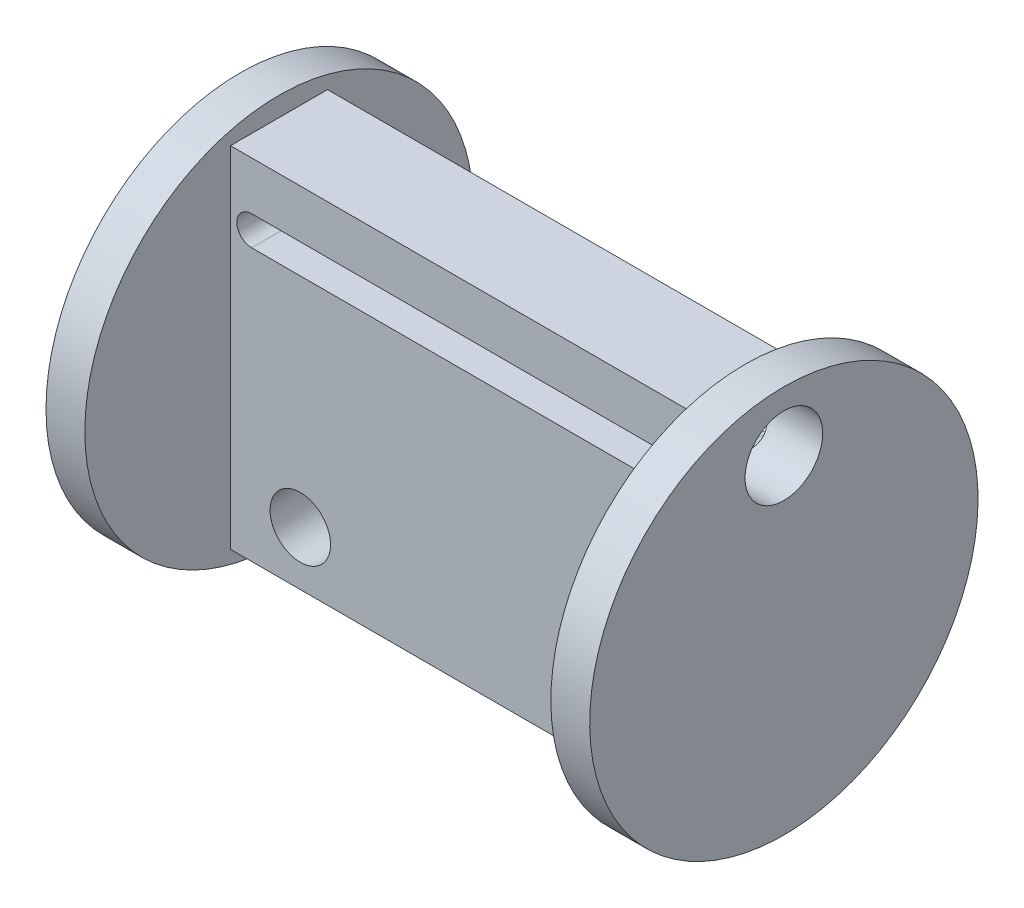
ISO-10303-21;
HEADER;
FILE_DESCRIPTION(('STEP AP214'),'2;1');
FILE_NAME('part.step','',(''),(''),'','','');
FILE_SCHEMA(('AUTOMOTIVE_DESIGN { 1 0 10303 214 1 1 1 1 }'));
ENDSEC;
DATA;
#1=APPLICATION_CONTEXT('core data for automotive mechanical design processes');
#2=APPLICATION_PROTOCOL_DEFINITION('international standard','automotive_design',2000,#1);
#3=PRODUCT_CONTEXT('',#1,'mechanical');
#4=PRODUCT('Part','Part','',(#3));
#5=PRODUCT_RELATED_PRODUCT_CATEGORY('part','',(#4));
#6=PRODUCT_DEFINITION_FORMATION('','',#4);
#7=PRODUCT_DEFINITION_CONTEXT('part definition',#1,'design');
#8=PRODUCT_DEFINITION('design','',#6,#7);
#9=PRODUCT_DEFINITION_SHAPE('','',#8);
#10=(LENGTH_UNIT() NAMED_UNIT(*) SI_UNIT(.MILLI.,.METRE.));
#11=(NAMED_UNIT(*) PLANE_ANGLE_UNIT() SI_UNIT($,.RADIAN.));
#12=(NAMED_UNIT(*) SI_UNIT($,.STERADIAN.) SOLID_ANGLE_UNIT());
#13=UNCERTAINTY_MEASURE_WITH_UNIT(LENGTH_MEASURE(1.E-05),#10,'distance_accuracy_value','');
#14=(GEOMETRIC_REPRESENTATION_CONTEXT(3) GLOBAL_UNCERTAINTY_ASSIGNED_CONTEXT((#13)) GLOBAL_UNIT_ASSIGNED_CONTEXT((#10,
#11,#12)) REPRESENTATION_CONTEXT('',''));
#15=CARTESIAN_POINT('',(0.,0.,0.));
#16=DIRECTION('',(0.,0.,1.));
#17=DIRECTION('',(1.,0.,0.));
#18=AXIS2_PLACEMENT_3D('',#15,#16,#17);
#19=CARTESIAN_POINT('',(1.0894743939662,-3.25,0.));
#20=DIRECTION('',(0.,0.,1.));
#21=DIRECTION('',(1.,0.,0.));
#22=AXIS2_PLACEMENT_3D('',#19,#20,#21);
#23=CYLINDRICAL_SURFACE('',#22,0.760008644446817);
#24=DIRECTION('',(0.,0.,1.));
#25=VECTOR('',#24,1.);
#26=CARTESIAN_POINT('',(1.0894743939662,-4.01000864444682,0.));
#27=LINE('',#26,#25);
#28=CARTESIAN_POINT('',(1.0894743939662,-4.01000864444682,3.01012686693727));
#29=VERTEX_POINT('',#28);
#30=CARTESIAN_POINT('',(1.0894743939662,-4.01000864444682,5.));
#31=VERTEX_POINT('',#30);
#32=EDGE_CURVE('E159',#29,#31,#27,.T.);
#33=ORIENTED_EDGE('',*,*,#32,.F.);
#34=CARTESIAN_POINT('',(1.0894743939662,-4.01000864444682,3.01012686693726));
#35=CARTESIAN_POINT('',(1.07707669593675,-4.01001725766991,3.01008270512241));
#36=CARTESIAN_POINT('',(1.06474771044255,-4.00970579351794,3.01127594601003));
#37=CARTESIAN_POINT('',(1.0407013282592,-4.00853348965439,3.01569435581647));
#38=CARTESIAN_POINT('',(1.02897697959905,-4.00768243768711,3.01888331081213));
#39=CARTESIAN_POINT('',(1.00119801770201,-4.0050453540771,3.02861536365552));
#40=CARTESIAN_POINT('',(0.985477073105324,-4.00301368661534,3.03601396432438));
#41=CARTESIAN_POINT('',(0.955241604369066,-3.99821880605652,3.05296383361457));
#42=CARTESIAN_POINT('',(0.940739596361213,-3.99544899461212,3.06253439701313));
#43=CARTESIAN_POINT('',(0.907276725120919,-3.9881174387055,3.08706023935537));
#44=CARTESIAN_POINT('',(0.888843641241601,-3.98328155978112,3.10264096883851));
#45=CARTESIAN_POINT('',(0.853522399582496,-3.9726882391371,3.13519917622143));
#46=CARTESIAN_POINT('',(0.836637753429081,-3.96692878033656,3.15217967080558));
#47=CARTESIAN_POINT('',(0.787605251630237,-3.94836981481272,3.20440658087747));
#48=CARTESIAN_POINT('',(0.757198605682099,-3.93431877587882,3.24083673263942));
#49=CARTESIAN_POINT('',(0.699257389265555,-3.90301313034175,3.31501916792411));
#50=CARTESIAN_POINT('',(0.671746949510896,-3.88573449910966,3.35277952025686));
#51=CARTESIAN_POINT('',(0.619336745591064,-3.84801917817134,3.42860556274431));
#52=CARTESIAN_POINT('',(0.594439591713472,-3.82757938038041,3.46667151806687));
#53=CARTESIAN_POINT('',(0.54729705765449,-3.78356577436914,3.54243986672158));
#54=CARTESIAN_POINT('',(0.525043913582875,-3.76000159463004,3.58014300990308));
#55=CARTESIAN_POINT('',(0.48331743672507,-3.70962596833462,3.65491191859255));
#56=CARTESIAN_POINT('',(0.463844010300835,-3.68281463121886,3.69197770553361));
#57=CARTESIAN_POINT('',(0.420612207913507,-3.61401611600752,3.78035382942408));
#58=CARTESIAN_POINT('',(0.398443963411168,-3.57035725363369,3.83117171390438));
#59=CARTESIAN_POINT('',(0.362264050466169,-3.47649344691324,3.92956950446195));
#60=CARTESIAN_POINT('',(0.348240235393714,-3.42629838826689,3.97715413853688));
#61=CARTESIAN_POINT('',(0.332821951204296,-3.33243863606246,4.05712488478613));
#62=CARTESIAN_POINT('',(0.329251911071941,-3.2899616388324,4.09047543072873));
#63=CARTESIAN_POINT('',(0.329698556359117,-3.20244337249887,4.15359642016833));
#64=CARTESIAN_POINT('',(0.333705883630236,-3.15740533294037,4.18337123144954));
#65=CARTESIAN_POINT('',(0.349198053599252,-3.07360077117895,4.23410374412514));
#66=CARTESIAN_POINT('',(0.359378913506381,-3.03498843324988,4.25570953322842));
#67=CARTESIAN_POINT('',(0.386488059929841,-2.95832717212267,4.29545016244364));
#68=CARTESIAN_POINT('',(0.403413701252699,-2.92027803410679,4.31358635915106));
#69=CARTESIAN_POINT('',(0.444238345977512,-2.84616789568757,4.34627668952145));
#70=CARTESIAN_POINT('',(0.468168180438604,-2.81011654194209,4.36081444990702));
#71=CARTESIAN_POINT('',(0.522595051779096,-2.74190263315745,4.38629673312687));
#72=CARTESIAN_POINT('',(0.553090819087876,-2.70973932821056,4.39724194957414));
#73=CARTESIAN_POINT('',(0.617094941885586,-2.6532197540716,4.41515342673418));
#74=CARTESIAN_POINT('',(0.650165228221357,-2.62844413262319,4.4223684866802));
#75=CARTESIAN_POINT('',(0.720212688861467,-2.5844406025447,4.43446991335676));
#76=CARTESIAN_POINT('',(0.757191093742846,-2.56521444846759,4.43935554391846));
#77=CARTESIAN_POINT('',(0.833485636182328,-2.53321901544216,4.44714279625735));
#78=CARTESIAN_POINT('',(0.872767326362223,-2.52037304367267,4.4500681388789));
#79=CARTESIAN_POINT('',(0.952918170482812,-2.50122997836981,4.45433284250991));
#80=CARTESIAN_POINT('',(0.993784274908442,-2.49492089494827,4.45567510781019));
#81=CARTESIAN_POINT('',(1.05304491232258,-2.49064367663592,4.45657806433126));
#82=CARTESIAN_POINT('',(1.07126483855795,-2.48998630515284,4.45671481182016));
#83=CARTESIAN_POINT('',(1.0894743939662,-2.48999135555318,4.45671755988468));
#84=B_SPLINE_CURVE_WITH_KNOTS('',3,(#34,#35,#36,#37,#38,#39,#40,#41,#42,#43,#44,#45,#46,#47,#48,
#49,#50,#51,#52,#53,#54,#55,#56,#57,#58,#59,#60,#61,#62,#63,#64,#65,#66,#67,#68,#69,#70,#71,#72,
#73,#74,#75,#76,#77,#78,#79,#80,#81,#82,#83),.UNSPECIFIED.,.F.,.F.,(4,2,2,2,2,2,2,2,2,2,2,2,2,2,
2,2,2,2,2,2,2,2,2,2,4),(0.,0.0370221329493267,0.0733912059623385,0.125573349591402,
0.178238582965131,0.251903381072083,0.325731309489078,0.473862198621621,0.623143132406903,
0.772571784623812,0.92155020134418,1.0705235983671,1.28150338370809,1.49216769963188,
1.65394479701112,1.81552222803366,1.95115520189047,2.08673503497121,2.22292087652167,
2.35908040916464,2.48431461503664,2.609588372446,2.73331745245764,2.85681918603891,
2.91146299670324),.UNSPECIFIED.);
#85=CARTESIAN_POINT('',(1.0894743939662,-2.48999135555318,4.45671755988467));
#86=VERTEX_POINT('',#85);
#87=EDGE_CURVE('E55',#29,#86,#84,.T.);
#88=ORIENTED_EDGE('',*,*,#87,.T.);
#89=DIRECTION('',(0.,0.,1.));
#90=VECTOR('',#89,1.);
#91=CARTESIAN_POINT('',(1.0894743939662,-2.48999135555318,0.));
#92=LINE('',#91,#90);
#93=CARTESIAN_POINT('',(1.0894743939662,-2.48999135555318,5.));
#94=VERTEX_POINT('',#93);
#95=EDGE_CURVE('E285',#86,#94,#92,.T.);
#96=ORIENTED_EDGE('',*,*,#95,.T.);
#97=CARTESIAN_POINT('',(1.0894743939662,-3.25,5.));
#98=DIRECTION('',(0.,0.,1.));
#99=DIRECTION('',(1.,0.,0.));
#100=AXIS2_PLACEMENT_3D('',#97,#98,#99);
#101=CIRCLE('',#100,0.760008644446817);
#102=EDGE_CURVE('E297',#94,#31,#101,.T.);
#103=ORIENTED_EDGE('',*,*,#102,.T.);
#104=EDGE_LOOP('',(#33,#88,#96,#103));
#105=FACE_BOUND('',#104,.T.);
#106=ADVANCED_FACE('F39',(#105),#23,.F.);
#107=CARTESIAN_POINT('',(1.0894743939662,-2.48999135555318,0.));
#108=DIRECTION('',(0.,1.,0.));
#109=DIRECTION('',(0.,0.,1.));
#110=AXIS2_PLACEMENT_3D('',#107,#108,#109);
#111=PLANE('',#110);
#112=ORIENTED_EDGE('',*,*,#95,.F.);
#113=DIRECTION('',(1.,0.,0.));
#114=VECTOR('',#113,1.);
#115=CARTESIAN_POINT('',(-2.00000000000001,-2.48999135555318,4.45671755988467));
#116=LINE('',#115,#114);
#117=CARTESIAN_POINT('',(22.6087489607478,-2.48999135555318,4.45671755988467));
#118=VERTEX_POINT('',#117);
#119=EDGE_CURVE('E145',#86,#118,#116,.T.);
#120=ORIENTED_EDGE('',*,*,#119,.T.);
#121=DIRECTION('',(0.,0.,1.));
#122=VECTOR('',#121,1.);
#123=CARTESIAN_POINT('',(22.6087489607478,-2.48999135555318,0.));
#124=LINE('',#123,#122);
#125=CARTESIAN_POINT('',(22.6087489607478,-2.48999135555318,5.));
#126=VERTEX_POINT('',#125);
#127=EDGE_CURVE('E143',#118,#126,#124,.T.);
#128=ORIENTED_EDGE('',*,*,#127,.T.);
#129=DIRECTION('',(-1.,0.,0.));
#130=VECTOR('',#129,1.);
#131=CARTESIAN_POINT('',(1.0894743939662,-2.48999135555318,5.));
#132=LINE('',#131,#130);
#133=EDGE_CURVE('E288',#126,#94,#132,.T.);
#134=ORIENTED_EDGE('',*,*,#133,.T.);
#135=EDGE_LOOP('',(#112,#120,#128,#134));
#136=FACE_BOUND('',#135,.T.);
#137=ADVANCED_FACE('F252',(#136),#111,.F.);
#138=CARTESIAN_POINT('',(22.6087489607478,-3.25,0.));
#139=DIRECTION('',(0.,0.,1.));
#140=DIRECTION('',(1.,0.,0.));
#141=AXIS2_PLACEMENT_3D('',#138,#139,#140);
#142=CYLINDRICAL_SURFACE('',#141,0.760008644446817);
#143=ORIENTED_EDGE('',*,*,#127,.F.);
#144=CARTESIAN_POINT('',(22.6087489607478,-2.48999135555318,4.45671755988467));
#145=CARTESIAN_POINT('',(22.650396817128,-2.48995091743924,4.45668825212347));
#146=CARTESIAN_POINT('',(22.6920382017036,-2.49341238822479,4.45599331803637));
#147=CARTESIAN_POINT('',(22.774138181362,-2.50705048602655,4.45305434618483));
#148=CARTESIAN_POINT('',(22.8145971297923,-2.51722508508035,4.45081077623685));
#149=CARTESIAN_POINT('',(22.893216659413,-2.54401054404058,4.44455472165866));
#150=CARTESIAN_POINT('',(22.9313755992,-2.56062593903091,4.44054099035014));
#151=CARTESIAN_POINT('',(23.0042466695067,-2.59969126930886,4.43036867368737));
#152=CARTESIAN_POINT('',(23.0389603882418,-2.62213849874586,4.42421108259028));
#153=CARTESIAN_POINT('',(23.1037424781654,-2.6718563397417,4.4094006142523));
#154=CARTESIAN_POINT('',(23.1338416496246,-2.69909210770836,4.40076549568854));
#155=CARTESIAN_POINT('',(23.188911588257,-2.75742179056977,4.3806467111987));
#156=CARTESIAN_POINT('',(23.2138820183606,-2.7885159588299,4.36916285815835));
#157=CARTESIAN_POINT('',(23.2581962896624,-2.85329955509753,4.34316836578676));
#158=CARTESIAN_POINT('',(23.2775428652366,-2.88698771176898,4.32865920330503));
#159=CARTESIAN_POINT('',(23.3104947663419,-2.95568933643229,4.29662603389218));
#160=CARTESIAN_POINT('',(23.3240999077704,-2.99070284688322,4.27910193031044));
#161=CARTESIAN_POINT('',(23.3463889023713,-3.06289548083096,4.24015163524459));
#162=CARTESIAN_POINT('',(23.3547486844604,-3.10008446715751,4.21856015068833));
#163=CARTESIAN_POINT('',(23.3658196370478,-3.17357080353304,4.1725955051394));
#164=CARTESIAN_POINT('',(23.3685257536811,-3.20986732718895,4.14821987588035));
#165=CARTESIAN_POINT('',(23.3690588782104,-3.2967901184907,4.08558200728034));
#166=CARTESIAN_POINT('',(23.3641356534276,-3.34649804176614,4.04601419050538));
#167=CARTESIAN_POINT('',(23.3459384845694,-3.44102380220434,3.96325669941267));
#168=CARTESIAN_POINT('',(23.3326567979343,-3.4858370601531,3.92006369922124));
#169=CARTESIAN_POINT('',(23.2934079620551,-3.58571698812543,3.81463469046051));
#170=CARTESIAN_POINT('',(23.2645674568227,-3.6384584666208,3.75125688633459));
#171=CARTESIAN_POINT('',(23.2143907040125,-3.71007355565516,3.65411084616992));
#172=CARTESIAN_POINT('',(23.1964312088276,-3.73276719936046,3.62125395276816));
#173=CARTESIAN_POINT('',(23.1584152195105,-3.77564290338846,3.55513278427947));
#174=CARTESIAN_POINT('',(23.1383600386532,-3.79582651947171,3.52186877571737));
#175=CARTESIAN_POINT('',(23.0955277018465,-3.83439706049717,3.45403319764897));
#176=CARTESIAN_POINT('',(23.072679702719,-3.85269603061699,3.41945672219525));
#177=CARTESIAN_POINT('',(23.0247349375482,-3.88673897648162,3.35046020080177));
#178=CARTESIAN_POINT('',(22.9996334180882,-3.90247734477975,3.31604065445097));
#179=CARTESIAN_POINT('',(22.947111885236,-3.93118336742588,3.24848183762855));
#180=CARTESIAN_POINT('',(22.9197190757809,-3.94417845823313,3.21533290097314));
#181=CARTESIAN_POINT('',(22.8614668272071,-3.96745474158667,3.15125575324192));
#182=CARTESIAN_POINT('',(22.8306247892121,-3.97774875176544,3.12031758009106));
#183=CARTESIAN_POINT('',(22.7839619444521,-3.98965076278692,3.08196251403101));
#184=CARTESIAN_POINT('',(22.7707319826043,-3.99267856305151,3.07188599709754));
#185=CARTESIAN_POINT('',(22.7431586101523,-3.99816145039333,3.05317583230621));
#186=CARTESIAN_POINT('',(22.7288162745737,-4.000617081459,3.04454081617857));
#187=CARTESIAN_POINT('',(22.7023993253935,-4.00430491914013,3.03131270615246));
#188=CARTESIAN_POINT('',(22.690587589262,-4.0056890742882,3.02624664906523));
#189=CARTESIAN_POINT('',(22.6662897652309,-4.0079244636796,3.01798140106297));
#190=CARTESIAN_POINT('',(22.6538061943623,-4.00877755455501,3.0147757088973));
#191=CARTESIAN_POINT('',(22.6357873120102,-4.00954651656528,3.01187624362259));
#192=CARTESIAN_POINT('',(22.6304090238071,-4.00971907988705,3.01122361831416));
#193=CARTESIAN_POINT('',(22.6196045825381,-4.00995038715874,3.01034777064865));
#194=CARTESIAN_POINT('',(22.6141783555984,-4.01000890426474,3.01012540410516));
#195=CARTESIAN_POINT('',(22.6087489607478,-4.01000864444682,3.01012686693723));
#196=B_SPLINE_CURVE_WITH_KNOTS('',3,(#144,#145,#146,#147,#148,#149,#150,#151,#152,#153,#154,
#155,#156,#157,#158,#159,#160,#161,#162,#163,#164,#165,#166,#167,#168,#169,#170,#171,#172,#173,
#174,#175,#176,#177,#178,#179,#180,#181,#182,#183,#184,#185,#186,#187,#188,#189,#190,#191,#192,
#193,#194,#195),.UNSPECIFIED.,.F.,.F.,(4,2,2,2,2,2,2,2,2,2,2,2,2,2,2,2,2,2,2,2,2,2,2,2,2,4),(0.,
0.124785734570131,0.249533789987741,0.374369842844549,0.499148077475175,0.623053350137903,
0.746966763463766,0.870819827654487,0.994676862969402,1.12558139498405,1.25660289381975,
1.44670305664321,1.63697957161495,1.89752547761004,2.02879570839622,2.15998416564351,
2.2957783397568,2.43186599854288,2.56652032367382,2.70052360952519,2.75116675214218,
2.80176154763907,2.84042441459786,2.87895134340027,2.89519655503515,2.91147404640414),.UNSPECIFIED.);
#197=CARTESIAN_POINT('',(22.6087489607478,-4.01000864444681,3.01012686693727));
#198=VERTEX_POINT('',#197);
#199=EDGE_CURVE('E129',#118,#198,#196,.T.);
#200=ORIENTED_EDGE('',*,*,#199,.T.);
#201=DIRECTION('',(0.,0.,1.));
#202=VECTOR('',#201,1.);
#203=CARTESIAN_POINT('',(22.6087489607478,-4.01000864444682,0.));
#204=LINE('',#203,#202);
#205=CARTESIAN_POINT('',(22.6087489607478,-4.01000864444682,5.));
#206=VERTEX_POINT('',#205);
#207=EDGE_CURVE('E141',#198,#206,#204,.T.);
#208=ORIENTED_EDGE('',*,*,#207,.T.);
#209=CARTESIAN_POINT('',(22.6087489607478,-3.25,5.));
#210=DIRECTION('',(0.,0.,1.));
#211=DIRECTION('',(1.,0.,0.));
#212=AXIS2_PLACEMENT_3D('',#209,#210,#211);
#213=CIRCLE('',#212,0.760008644446817);
#214=EDGE_CURVE('E292',#206,#126,#213,.T.);
#215=ORIENTED_EDGE('',*,*,#214,.T.);
#216=EDGE_LOOP('',(#143,#200,#208,#215));
#217=FACE_BOUND('',#216,.T.);
#218=ADVANCED_FACE('F139',(#217),#142,.F.);
#219=CARTESIAN_POINT('',(1.0894743939662,-4.01000864444682,0.));
#220=DIRECTION('',(0.,-1.,0.));
#221=DIRECTION('',(0.,0.,-1.));
#222=AXIS2_PLACEMENT_3D('',#219,#220,#221);
#223=PLANE('',#222);
#224=CARTESIAN_POINT('',(1.0894743939662,-4.01000864444682,0.));
#225=VERTEX_POINT('',#224);
#226=CARTESIAN_POINT('',(1.0894743939662,-4.01000864444682,1.98987313306273));
#227=VERTEX_POINT('',#226);
#228=EDGE_CURVE('E153',#225,#227,#27,.T.);
#229=ORIENTED_EDGE('',*,*,#228,.T.);
#230=DIRECTION('',(1.,0.,0.));
#231=VECTOR('',#230,1.);
#232=CARTESIAN_POINT('',(-2.00000000000001,-4.01000864444682,1.98987313306273));
#233=LINE('',#232,#231);
#234=CARTESIAN_POINT('',(22.6087489607478,-4.01000864444682,1.98987313306273));
#235=VERTEX_POINT('',#234);
#236=EDGE_CURVE('E365',#227,#235,#233,.T.);
#237=ORIENTED_EDGE('',*,*,#236,.T.);
#238=CARTESIAN_POINT('',(22.6087489607478,-4.01000864444682,0.));
#239=VERTEX_POINT('',#238);
#240=EDGE_CURVE('E152',#239,#235,#204,.T.);
#241=ORIENTED_EDGE('',*,*,#240,.F.);
#242=DIRECTION('',(1.,0.,0.));
#243=VECTOR('',#242,1.);
#244=CARTESIAN_POINT('',(1.0894743939662,-4.01000864444682,0.));
#245=LINE('',#244,#243);
#246=EDGE_CURVE('E309',#225,#239,#245,.T.);
#247=ORIENTED_EDGE('',*,*,#246,.F.);
#248=EDGE_LOOP('',(#229,#237,#241,#247));
#249=FACE_BOUND('',#248,.T.);
#250=ADVANCED_FACE('F372',(#249),#223,.F.);
#251=CARTESIAN_POINT('',(0.,-18.,5.));
#252=DIRECTION('',(0.,1.,0.));
#253=DIRECTION('',(0.,0.,1.));
#254=AXIS2_PLACEMENT_3D('',#251,#252,#253);
#255=PLANE('',#254);
#256=DIRECTION('',(1.,0.,0.));
#257=VECTOR('',#256,1.);
#258=CARTESIAN_POINT('',(0.,-18.,0.));
#259=LINE('',#258,#257);
#260=CARTESIAN_POINT('',(0.,-18.,0.));
#261=VERTEX_POINT('',#260);
#262=CARTESIAN_POINT('',(24.,-18.,0.));
#263=VERTEX_POINT('',#262);
#264=EDGE_CURVE('E201',#261,#263,#259,.T.);
#265=ORIENTED_EDGE('',*,*,#264,.T.);
#266=DIRECTION('',(0.,0.,-1.));
#267=VECTOR('',#266,1.);
#268=CARTESIAN_POINT('',(24.,-18.,5.));
#269=LINE('',#268,#267);
#270=CARTESIAN_POINT('',(24.,-18.,5.));
#271=VERTEX_POINT('',#270);
#272=EDGE_CURVE('E48',#271,#263,#269,.T.);
#273=ORIENTED_EDGE('',*,*,#272,.F.);
#274=DIRECTION('',(1.,0.,0.));
#275=VECTOR('',#274,1.);
#276=CARTESIAN_POINT('',(0.,-18.,5.));
#277=LINE('',#276,#275);
#278=CARTESIAN_POINT('',(0.,-18.,5.));
#279=VERTEX_POINT('',#278);
#280=EDGE_CURVE('E187',#279,#271,#277,.T.);
#281=ORIENTED_EDGE('',*,*,#280,.F.);
#282=DIRECTION('',(0.,0.,-1.));
#283=VECTOR('',#282,1.);
#284=CARTESIAN_POINT('',(0.,-18.,5.));
#285=LINE('',#284,#283);
#286=EDGE_CURVE('E11',#279,#261,#285,.T.);
#287=ORIENTED_EDGE('',*,*,#286,.T.);
#288=EDGE_LOOP('',(#265,#273,#281,#287));
#289=FACE_BOUND('',#288,.T.);
#290=ADVANCED_FACE('F41',(#289),#255,.F.);
#291=CARTESIAN_POINT('',(0.,0.,5.));
#292=DIRECTION('',(0.,-1.,0.));
#293=DIRECTION('',(0.,0.,-1.));
#294=AXIS2_PLACEMENT_3D('',#291,#292,#293);
#295=PLANE('',#294);
#296=DIRECTION('',(-1.,0.,0.));
#297=VECTOR('',#296,1.);
#298=CARTESIAN_POINT('',(0.,0.,0.));
#299=LINE('',#298,#297);
#300=CARTESIAN_POINT('',(24.,0.,0.));
#301=VERTEX_POINT('',#300);
#302=CARTESIAN_POINT('',(0.,0.,0.));
#303=VERTEX_POINT('',#302);
#304=EDGE_CURVE('E188',#301,#303,#299,.T.);
#305=ORIENTED_EDGE('',*,*,#304,.T.);
#306=DIRECTION('',(0.,0.,-1.));
#307=VECTOR('',#306,1.);
#308=CARTESIAN_POINT('',(0.,0.,5.));
#309=LINE('',#308,#307);
#310=CARTESIAN_POINT('',(0.,0.,5.));
#311=VERTEX_POINT('',#310);
#312=EDGE_CURVE('E197',#311,#303,#309,.T.);
#313=ORIENTED_EDGE('',*,*,#312,.F.);
#314=DIRECTION('',(-1.,0.,0.));
#315=VECTOR('',#314,1.);
#316=CARTESIAN_POINT('',(0.,0.,5.));
#317=LINE('',#316,#315);
#318=CARTESIAN_POINT('',(24.,0.,5.));
#319=VERTEX_POINT('',#318);
#320=EDGE_CURVE('E194',#319,#311,#317,.T.);
#321=ORIENTED_EDGE('',*,*,#320,.F.);
#322=DIRECTION('',(0.,0.,-1.));
#323=VECTOR('',#322,1.);
#324=CARTESIAN_POINT('',(24.,0.,5.));
#325=LINE('',#324,#323);
#326=EDGE_CURVE('E215',#319,#301,#325,.T.);
#327=ORIENTED_EDGE('',*,*,#326,.T.);
#328=EDGE_LOOP('',(#305,#313,#321,#327));
#329=FACE_BOUND('',#328,.T.);
#330=ADVANCED_FACE('F231',(#329),#295,.F.);
#331=CARTESIAN_POINT('',(0.,0.,5.));
#332=DIRECTION('',(0.,0.,1.));
#333=DIRECTION('',(1.,0.,0.));
#334=AXIS2_PLACEMENT_3D('',#331,#332,#333);
#335=PLANE('',#334);
#336=ORIENTED_EDGE('',*,*,#102,.F.);
#337=ORIENTED_EDGE('',*,*,#133,.F.);
#338=ORIENTED_EDGE('',*,*,#214,.F.);
#339=DIRECTION('',(1.,0.,0.));
#340=VECTOR('',#339,1.);
#341=CARTESIAN_POINT('',(1.0894743939662,-4.01000864444682,5.));
#342=LINE('',#341,#340);
#343=EDGE_CURVE('E149',#31,#206,#342,.T.);
#344=ORIENTED_EDGE('',*,*,#343,.F.);
#345=EDGE_LOOP('',(#336,#337,#338,#344));
#346=FACE_BOUND('',#345,.T.);
#347=CARTESIAN_POINT('',(3.59586,-15.22505,5.));
#348=DIRECTION('',(0.,0.,1.));
#349=DIRECTION('',(1.,0.,0.));
#350=AXIS2_PLACEMENT_3D('',#347,#348,#349);
#351=CIRCLE('',#350,1.5575);
#352=CARTESIAN_POINT('',(5.15336,-15.22505,5.));
#353=VERTEX_POINT('',#352);
#354=EDGE_CURVE('E170',#353,#353,#351,.T.);
#355=ORIENTED_EDGE('',*,*,#354,.F.);
#356=EDGE_LOOP('',(#355));
#357=FACE_BOUND('',#356,.T.);
#358=CARTESIAN_POINT('',(19.14986,-15.22505,5.));
#359=DIRECTION('',(0.,0.,1.));
#360=DIRECTION('',(1.,0.,0.));
#361=AXIS2_PLACEMENT_3D('',#358,#359,#360);
#362=CIRCLE('',#361,1.5575);
#363=CARTESIAN_POINT('',(20.70736,-15.22505,5.));
#364=VERTEX_POINT('',#363);
#365=EDGE_CURVE('E178',#364,#364,#362,.T.);
#366=ORIENTED_EDGE('',*,*,#365,.F.);
#367=EDGE_LOOP('',(#366));
#368=FACE_BOUND('',#367,.T.);
#369=DIRECTION('',(0.,-1.,0.));
#370=VECTOR('',#369,1.);
#371=CARTESIAN_POINT('',(0.,0.,5.));
#372=LINE('',#371,#370);
#373=EDGE_CURVE('E183',#311,#279,#372,.T.);
#374=ORIENTED_EDGE('',*,*,#373,.T.);
#375=ORIENTED_EDGE('',*,*,#280,.T.);
#376=DIRECTION('',(0.,1.,0.));
#377=VECTOR('',#376,1.);
#378=CARTESIAN_POINT('',(24.,0.,5.));
#379=LINE('',#378,#377);
#380=EDGE_CURVE('E191',#271,#319,#379,.T.);
#381=ORIENTED_EDGE('',*,*,#380,.T.);
#382=ORIENTED_EDGE('',*,*,#320,.T.);
#383=EDGE_LOOP('',(#374,#375,#381,#382));
#384=FACE_BOUND('',#383,.T.);
#385=ADVANCED_FACE('F237',(#346,#357,#368,#384),#335,.T.);
#386=CARTESIAN_POINT('',(0.,0.,0.));
#387=DIRECTION('',(0.,0.,1.));
#388=DIRECTION('',(1.,0.,0.));
#389=AXIS2_PLACEMENT_3D('',#386,#387,#388);
#390=PLANE('',#389);
#391=DIRECTION('',(-1.,0.,0.));
#392=VECTOR('',#391,1.);
#393=CARTESIAN_POINT('',(1.0894743939662,-2.48999135555318,0.));
#394=LINE('',#393,#392);
#395=CARTESIAN_POINT('',(22.6087489607478,-2.48999135555318,0.));
#396=VERTEX_POINT('',#395);
#397=CARTESIAN_POINT('',(1.0894743939662,-2.48999135555318,0.));
#398=VERTEX_POINT('',#397);
#399=EDGE_CURVE('E302',#396,#398,#394,.T.);
#400=ORIENTED_EDGE('',*,*,#399,.T.);
#401=CARTESIAN_POINT('',(1.0894743939662,-3.25,0.));
#402=DIRECTION('',(0.,0.,1.));
#403=DIRECTION('',(1.,0.,0.));
#404=AXIS2_PLACEMENT_3D('',#401,#402,#403);
#405=CIRCLE('',#404,0.760008644446817);
#406=EDGE_CURVE('E280',#398,#225,#405,.T.);
#407=ORIENTED_EDGE('',*,*,#406,.T.);
#408=ORIENTED_EDGE('',*,*,#246,.T.);
#409=CARTESIAN_POINT('',(22.6087489607478,-3.25,0.));
#410=DIRECTION('',(0.,0.,1.));
#411=DIRECTION('',(1.,0.,0.));
#412=AXIS2_PLACEMENT_3D('',#409,#410,#411);
#413=CIRCLE('',#412,0.760008644446817);
#414=EDGE_CURVE('E305',#239,#396,#413,.T.);
#415=ORIENTED_EDGE('',*,*,#414,.T.);
#416=EDGE_LOOP('',(#400,#407,#408,#415));
#417=FACE_BOUND('',#416,.T.);
#418=CARTESIAN_POINT('',(3.59586,-15.22505,0.));
#419=DIRECTION('',(0.,0.,1.));
#420=DIRECTION('',(1.,0.,0.));
#421=AXIS2_PLACEMENT_3D('',#418,#419,#420);
#422=CIRCLE('',#421,1.5575);
#423=CARTESIAN_POINT('',(5.15336,-15.22505,0.));
#424=VERTEX_POINT('',#423);
#425=EDGE_CURVE('E165',#424,#424,#422,.T.);
#426=ORIENTED_EDGE('',*,*,#425,.T.);
#427=EDGE_LOOP('',(#426));
#428=FACE_BOUND('',#427,.T.);
#429=CARTESIAN_POINT('',(19.14986,-15.22505,0.));
#430=DIRECTION('',(0.,0.,1.));
#431=DIRECTION('',(1.,0.,0.));
#432=AXIS2_PLACEMENT_3D('',#429,#430,#431);
#433=CIRCLE('',#432,1.5575);
#434=CARTESIAN_POINT('',(20.70736,-15.22505,0.));
#435=VERTEX_POINT('',#434);
#436=EDGE_CURVE('E174',#435,#435,#433,.T.);
#437=ORIENTED_EDGE('',*,*,#436,.T.);
#438=EDGE_LOOP('',(#437));
#439=FACE_BOUND('',#438,.T.);
#440=DIRECTION('',(0.,-1.,0.));
#441=VECTOR('',#440,1.);
#442=CARTESIAN_POINT('',(0.,0.,0.));
#443=LINE('',#442,#441);
#444=EDGE_CURVE('E169',#303,#261,#443,.T.);
#445=ORIENTED_EDGE('',*,*,#444,.F.);
#446=ORIENTED_EDGE('',*,*,#304,.F.);
#447=DIRECTION('',(0.,1.,0.));
#448=VECTOR('',#447,1.);
#449=CARTESIAN_POINT('',(24.,0.,0.));
#450=LINE('',#449,#448);
#451=EDGE_CURVE('E205',#263,#301,#450,.T.);
#452=ORIENTED_EDGE('',*,*,#451,.F.);
#453=ORIENTED_EDGE('',*,*,#264,.F.);
#454=EDGE_LOOP('',(#445,#446,#452,#453));
#455=FACE_BOUND('',#454,.T.);
#456=ADVANCED_FACE('F227',(#417,#428,#439,#455),#390,.F.);
#457=CARTESIAN_POINT('',(19.14986,-15.22505,0.));
#458=DIRECTION('',(0.,0.,1.));
#459=DIRECTION('',(1.,0.,0.));
#460=AXIS2_PLACEMENT_3D('',#457,#458,#459);
#461=CYLINDRICAL_SURFACE('',#460,1.5575);
#462=ORIENTED_EDGE('',*,*,#436,.F.);
#463=EDGE_LOOP('',(#462));
#464=FACE_BOUND('',#463,.T.);
#465=ORIENTED_EDGE('',*,*,#365,.T.);
#466=EDGE_LOOP('',(#465));
#467=FACE_BOUND('',#466,.T.);
#468=ADVANCED_FACE('F245',(#464,#467),#461,.F.);
#469=CARTESIAN_POINT('',(3.59586,-15.22505,0.));
#470=DIRECTION('',(0.,0.,1.));
#471=DIRECTION('',(1.,0.,0.));
#472=AXIS2_PLACEMENT_3D('',#469,#470,#471);
#473=CYLINDRICAL_SURFACE('',#472,1.5575);
#474=ORIENTED_EDGE('',*,*,#425,.F.);
#475=EDGE_LOOP('',(#474));
#476=FACE_BOUND('',#475,.T.);
#477=ORIENTED_EDGE('',*,*,#354,.T.);
#478=EDGE_LOOP('',(#477));
#479=FACE_BOUND('',#478,.T.);
#480=ADVANCED_FACE('F266',(#476,#479),#473,.F.);
#481=CARTESIAN_POINT('',(1.0894743939662,-2.48999135555318,0.543282440115328));
#482=VERTEX_POINT('',#481);
#483=EDGE_CURVE('E182',#398,#482,#92,.T.);
#484=ORIENTED_EDGE('',*,*,#483,.T.);
#485=CARTESIAN_POINT('',(1.0894743939662,-2.48999135555318,0.543282440115329));
#486=CARTESIAN_POINT('',(1.04782653758603,-2.48995091743924,0.543311747876525));
#487=CARTESIAN_POINT('',(1.0061851530104,-2.49341238822479,0.544006681963625));
#488=CARTESIAN_POINT('',(0.924085173352021,-2.50705048602655,0.546945653815166));
#489=CARTESIAN_POINT('',(0.88362622492166,-2.51722508508035,0.549189223763151));
#490=CARTESIAN_POINT('',(0.805006695301013,-2.54401054404058,0.555445278341337));
#491=CARTESIAN_POINT('',(0.766847755513952,-2.56062593903091,0.559459009649857));
#492=CARTESIAN_POINT('',(0.693976685207297,-2.59969126930886,0.569631326312626));
#493=CARTESIAN_POINT('',(0.659262966472228,-2.62213849874586,0.575788917409719));
#494=CARTESIAN_POINT('',(0.594480876548569,-2.6718563397417,0.590599385747694));
#495=CARTESIAN_POINT('',(0.564381705089362,-2.69909210770836,0.599234504311458));
#496=CARTESIAN_POINT('',(0.509311766456938,-2.75742179056977,0.619353288801294));
#497=CARTESIAN_POINT('',(0.484341336353397,-2.7885159588299,0.630837141841646));
#498=CARTESIAN_POINT('',(0.440027065051577,-2.85329955509753,0.656831634213235));
#499=CARTESIAN_POINT('',(0.420680489477389,-2.88698771176898,0.671340796694959));
#500=CARTESIAN_POINT('',(0.387728588372048,-2.95568933643229,0.703373966107815));
#501=CARTESIAN_POINT('',(0.37412344694357,-2.99070284688322,0.720898069689558));
#502=CARTESIAN_POINT('',(0.351834452342666,-3.06289548083096,0.759848364755399));
#503=CARTESIAN_POINT('',(0.343474670253594,-3.10008446715751,0.781439849311667));
#504=CARTESIAN_POINT('',(0.332403717666161,-3.17357080353304,0.827404494860594));
#505=CARTESIAN_POINT('',(0.329697601032916,-3.20986732718895,0.851780124119647));
#506=CARTESIAN_POINT('',(0.329164476503618,-3.2967901184907,0.914417992719654));
#507=CARTESIAN_POINT('',(0.334087701286393,-3.34649804176614,0.953985809494608));
#508=CARTESIAN_POINT('',(0.352284870144598,-3.44102380220434,1.03674330058732));
#509=CARTESIAN_POINT('',(0.365566556779705,-3.48583706015309,1.07993630077875));
#510=CARTESIAN_POINT('',(0.404815392658876,-3.58571698812543,1.18536530953948));
#511=CARTESIAN_POINT('',(0.433655897891279,-3.6384584666208,1.24874311366539));
#512=CARTESIAN_POINT('',(0.483832650701512,-3.71007355565516,1.34588915383006));
#513=CARTESIAN_POINT('',(0.501792145886423,-3.73276719936046,1.37874604723183));
#514=CARTESIAN_POINT('',(0.539808135203448,-3.77564290338845,1.44486721572051));
#515=CARTESIAN_POINT('',(0.559863316060788,-3.79582651947171,1.47813122428261));
#516=CARTESIAN_POINT('',(0.602695652867437,-3.83439706049717,1.54596680235101));
#517=CARTESIAN_POINT('',(0.625543651995034,-3.85269603061699,1.58054327780473));
#518=CARTESIAN_POINT('',(0.67348841716583,-3.88673897648162,1.64953979919821));
#519=CARTESIAN_POINT('',(0.69858993662579,-3.90247734477975,1.68395934554901));
#520=CARTESIAN_POINT('',(0.751111469477955,-3.93118336742588,1.75151816237142));
#521=CARTESIAN_POINT('',(0.778504278933081,-3.94417845823313,1.78466709902684));
#522=CARTESIAN_POINT('',(0.836756527506913,-3.96745474158667,1.84874424675805));
#523=CARTESIAN_POINT('',(0.867598565501889,-3.97774875176544,1.87968241990892));
#524=CARTESIAN_POINT('',(0.914261410261931,-3.98965076278692,1.91803748596897));
#525=CARTESIAN_POINT('',(0.927491372109684,-3.99267856305151,1.92811400290243));
#526=CARTESIAN_POINT('',(0.955064744561651,-3.99816145039333,1.94682416769376));
#527=CARTESIAN_POINT('',(0.969407080140316,-4.000617081459,1.9554591838214));
#528=CARTESIAN_POINT('',(0.995824029320536,-4.00430491914013,1.96868729384751));
#529=CARTESIAN_POINT('',(1.00763576545199,-4.0056890742882,1.97375335093474));
#530=CARTESIAN_POINT('',(1.03193358948311,-4.0079244636796,1.982018598937));
#531=CARTESIAN_POINT('',(1.04441716035173,-4.00877755455501,1.98522429110266));
#532=CARTESIAN_POINT('',(1.06243604270381,-4.00954651656528,1.98812375637738));
#533=CARTESIAN_POINT('',(1.06781433090692,-4.00971907988705,1.9887763816858));
#534=CARTESIAN_POINT('',(1.07861877217586,-4.00995038715874,1.98965222935132));
#535=CARTESIAN_POINT('',(1.0840449991156,-4.01000890426474,1.98987459589481));
#536=CARTESIAN_POINT('',(1.0894743939662,-4.01000864444682,1.98987313306274));
#537=B_SPLINE_CURVE_WITH_KNOTS('',3,(#485,#486,#487,#488,#489,#490,#491,#492,#493,#494,#495,
#496,#497,#498,#499,#500,#501,#502,#503,#504,#505,#506,#507,#508,#509,#510,#511,#512,#513,#514,
#515,#516,#517,#518,#519,#520,#521,#522,#523,#524,#525,#526,#527,#528,#529,#530,#531,#532,#533,
#534,#535,#536),.UNSPECIFIED.,.F.,.F.,(4,2,2,2,2,2,2,2,2,2,2,2,2,2,2,2,2,2,2,2,2,2,2,2,2,4),(0.,
0.124785734570132,0.249533789987741,0.374369842844548,0.499148077475173,0.623053350137902,
0.746966763463764,0.870819827654486,0.994676862969402,1.12558139498405,1.25660289381975,
1.44670305664321,1.63697957161495,1.89752547761003,2.02879570839621,2.15998416564349,
2.29577833975679,2.43186599854286,2.56652032367381,2.70052360952517,2.75116675214217,
2.80176154763905,2.84042441459786,2.87895134340026,2.89519655503514,2.91147404640412),.UNSPECIFIED.);
#538=EDGE_CURVE('E278',#482,#227,#537,.T.);
#539=ORIENTED_EDGE('',*,*,#538,.T.);
#540=ORIENTED_EDGE('',*,*,#228,.F.);
#541=ORIENTED_EDGE('',*,*,#406,.F.);
#542=EDGE_LOOP('',(#484,#539,#540,#541));
#543=FACE_BOUND('',#542,.T.);
#544=ADVANCED_FACE('F255',(#543),#23,.F.);
#545=CARTESIAN_POINT('',(22.6087489607478,-2.48999135555318,0.54328244011533));
#546=VERTEX_POINT('',#545);
#547=EDGE_CURVE('E162',#396,#546,#124,.T.);
#548=ORIENTED_EDGE('',*,*,#547,.T.);
#549=DIRECTION('',(1.,0.,0.));
#550=VECTOR('',#549,1.);
#551=CARTESIAN_POINT('',(-2.00000000000001,-2.48999135555318,0.543282440115328));
#552=LINE('',#551,#550);
#553=EDGE_CURVE('E337',#546,#482,#552,.F.);
#554=ORIENTED_EDGE('',*,*,#553,.T.);
#555=ORIENTED_EDGE('',*,*,#483,.F.);
#556=ORIENTED_EDGE('',*,*,#399,.F.);
#557=EDGE_LOOP('',(#548,#554,#555,#556));
#558=FACE_BOUND('',#557,.T.);
#559=ADVANCED_FACE('F261',(#558),#111,.F.);
#560=ORIENTED_EDGE('',*,*,#240,.T.);
#561=CARTESIAN_POINT('',(22.6087489607478,-4.01000864444682,1.98987313306277));
#562=CARTESIAN_POINT('',(22.6211466587772,-4.01001725766991,1.98991729487762));
#563=CARTESIAN_POINT('',(22.6334756442714,-4.00970579351794,1.98872405399));
#564=CARTESIAN_POINT('',(22.6575220264548,-4.00853348965439,1.98430564418356));
#565=CARTESIAN_POINT('',(22.6692463751149,-4.00768243768711,1.9811166891879));
#566=CARTESIAN_POINT('',(22.697025337012,-4.0050453540771,1.97138463634451));
#567=CARTESIAN_POINT('',(22.7127462816087,-4.00301368661534,1.96398603567565));
#568=CARTESIAN_POINT('',(22.7429817503449,-3.99821880605652,1.94703616638546));
#569=CARTESIAN_POINT('',(22.7574837583528,-3.99544899461212,1.9374656029869));
#570=CARTESIAN_POINT('',(22.7909466295931,-3.9881174387055,1.91293976064466));
#571=CARTESIAN_POINT('',(22.8093797134724,-3.98328155978112,1.89735903116153));
#572=CARTESIAN_POINT('',(22.8447009551315,-3.97268823913711,1.86480082377861));
#573=CARTESIAN_POINT('',(22.8615856012849,-3.96692878033657,1.84782032919445));
#574=CARTESIAN_POINT('',(22.9106181030837,-3.94836981481272,1.79559341912257));
#575=CARTESIAN_POINT('',(22.9410247490319,-3.93431877587883,1.75916326736062));
#576=CARTESIAN_POINT('',(22.9989659654484,-3.90301313034177,1.68498083207594));
#577=CARTESIAN_POINT('',(23.0264764052031,-3.88573449910967,1.64722047974318));
#578=CARTESIAN_POINT('',(23.0788866091229,-3.84801917817135,1.57139443725573));
#579=CARTESIAN_POINT('',(23.1037837630005,-3.82757938038042,1.53332848193317));
#580=CARTESIAN_POINT('',(23.1509262970595,-3.78356577436916,1.45756013327846));
#581=CARTESIAN_POINT('',(23.1731794411311,-3.76000159463006,1.41985699009695));
#582=CARTESIAN_POINT('',(23.2149059179889,-3.70962596833463,1.34508808140748));
#583=CARTESIAN_POINT('',(23.2343793444131,-3.68281463121887,1.30802229446642));
#584=CARTESIAN_POINT('',(23.2776111468005,-3.61401611600754,1.21964617057594));
#585=CARTESIAN_POINT('',(23.2997793913028,-3.5703572536337,1.16882828609564));
#586=CARTESIAN_POINT('',(23.3359593042478,-3.47649344691325,1.07043049553807));
#587=CARTESIAN_POINT('',(23.3499831193203,-3.4262983882669,1.02284586146314));
#588=CARTESIAN_POINT('',(23.3654014035097,-3.33243863606247,0.942875115213891));
#589=CARTESIAN_POINT('',(23.368971443642,-3.28996163883241,0.909524569271289));
#590=CARTESIAN_POINT('',(23.3685247983549,-3.20244337249889,0.846403579831689));
#591=CARTESIAN_POINT('',(23.3645174710838,-3.15740533294038,0.816628768550473));
#592=CARTESIAN_POINT('',(23.3490253011147,-3.07360077117896,0.765896255874874));
#593=CARTESIAN_POINT('',(23.3388444412076,-3.0349884332499,0.744290466771592));
#594=CARTESIAN_POINT('',(23.3117352947841,-2.95832717212269,0.704549837556372));
#595=CARTESIAN_POINT('',(23.2948096534613,-2.9202780341068,0.686413640848944));
#596=CARTESIAN_POINT('',(23.2539850087365,-2.84616789568758,0.653723310478552));
#597=CARTESIAN_POINT('',(23.2300551742754,-2.8101165419421,0.639185550092988));
#598=CARTESIAN_POINT('',(23.1756283029349,-2.74190263315746,0.613703266873131));
#599=CARTESIAN_POINT('',(23.1451325356261,-2.70973932821057,0.602758050425864));
#600=CARTESIAN_POINT('',(23.0811284128284,-2.65321975407161,0.584846573265823));
#601=CARTESIAN_POINT('',(23.0480581264926,-2.6284441326232,0.577631513319802));
#602=CARTESIAN_POINT('',(22.9780106658525,-2.58444060254471,0.565530086643239));
#603=CARTESIAN_POINT('',(22.9410322609712,-2.56521444846759,0.560644456081546));
#604=CARTESIAN_POINT('',(22.8647377185317,-2.53321901544217,0.55285720374265));
#605=CARTESIAN_POINT('',(22.8254560283518,-2.52037304367268,0.549931861121104));
#606=CARTESIAN_POINT('',(22.7453051842312,-2.50122997836981,0.545667157490087));
#607=CARTESIAN_POINT('',(22.7044390798055,-2.49492089494827,0.544324892189807));
#608=CARTESIAN_POINT('',(22.6451784423914,-2.49064367663592,0.543421935668736));
#609=CARTESIAN_POINT('',(22.626958516156,-2.48998630515284,0.543285188179836));
#610=CARTESIAN_POINT('',(22.6087489607478,-2.48999135555318,0.543282440115317));
#611=B_SPLINE_CURVE_WITH_KNOTS('',3,(#561,#562,#563,#564,#565,#566,#567,#568,#569,#570,#571,
#572,#573,#574,#575,#576,#577,#578,#579,#580,#581,#582,#583,#584,#585,#586,#587,#588,#589,#590,
#591,#592,#593,#594,#595,#596,#597,#598,#599,#600,#601,#602,#603,#604,#605,#606,#607,#608,#609,
#610),.UNSPECIFIED.,.F.,.F.,(4,2,2,2,2,2,2,2,2,2,2,2,2,2,2,2,2,2,2,2,2,2,2,2,4),(0.,
0.0370221329493203,0.0733912059623333,0.125573349591396,0.178238582965121,0.25190338107207,
0.325731309489061,0.473862198621595,0.623143132406883,0.772571784623794,0.921550201344166,
1.07052359836709,1.28150338370808,1.49216769963188,1.65394479701112,1.81552222803366,
1.95115520189048,2.08673503497121,2.22292087652168,2.35908040916464,2.48431461503665,
2.60958837244601,2.73331745245765,2.85681918603893,2.91146299670326),.UNSPECIFIED.);
#612=EDGE_CURVE('E63',#235,#546,#611,.T.);
#613=ORIENTED_EDGE('',*,*,#612,.T.);
#614=ORIENTED_EDGE('',*,*,#547,.F.);
#615=ORIENTED_EDGE('',*,*,#414,.F.);
#616=EDGE_LOOP('',(#560,#613,#614,#615));
#617=FACE_BOUND('',#616,.T.);
#618=ADVANCED_FACE('F272',(#617),#142,.F.);
#619=ORIENTED_EDGE('',*,*,#207,.F.);
#620=DIRECTION('',(1.,0.,0.));
#621=VECTOR('',#620,1.);
#622=CARTESIAN_POINT('',(-2.00000000000001,-4.01000864444682,3.01012686693727));
#623=LINE('',#622,#621);
#624=EDGE_CURVE('E126',#198,#29,#623,.F.);
#625=ORIENTED_EDGE('',*,*,#624,.T.);
#626=ORIENTED_EDGE('',*,*,#32,.T.);
#627=ORIENTED_EDGE('',*,*,#343,.T.);
#628=EDGE_LOOP('',(#619,#625,#626,#627));
#629=FACE_BOUND('',#628,.T.);
#630=ADVANCED_FACE('F147',(#629),#223,.F.);
#631=CARTESIAN_POINT('',(0.,-9.,2.5));
#632=DIRECTION('',(-1.,0.,0.));
#633=DIRECTION('',(0.,0.,1.));
#634=AXIS2_PLACEMENT_3D('',#631,#632,#633);
#635=PLANE('',#634);
#636=CARTESIAN_POINT('',(0.,-9.,2.5));
#637=DIRECTION('',(-1.,0.,0.));
#638=DIRECTION('',(0.,0.,1.));
#639=AXIS2_PLACEMENT_3D('',#636,#637,#638);
#640=CIRCLE('',#639,10.);
#641=CARTESIAN_POINT('',(0.,-9.,12.5));
#642=VERTEX_POINT('',#641);
#643=EDGE_CURVE('E315',#642,#642,#640,.T.);
#644=ORIENTED_EDGE('',*,*,#643,.F.);
#645=EDGE_LOOP('',(#644));
#646=FACE_BOUND('',#645,.T.);
#647=ORIENTED_EDGE('',*,*,#312,.T.);
#648=ORIENTED_EDGE('',*,*,#444,.T.);
#649=ORIENTED_EDGE('',*,*,#286,.F.);
#650=ORIENTED_EDGE('',*,*,#373,.F.);
#651=EDGE_LOOP('',(#647,#648,#649,#650));
#652=FACE_BOUND('',#651,.T.);
#653=ADVANCED_FACE('F235',(#646,#652),#635,.F.);
#654=CARTESIAN_POINT('',(-2.,-9.,2.5));
#655=DIRECTION('',(1.,0.,0.));
#656=DIRECTION('',(0.,0.,-1.));
#657=AXIS2_PLACEMENT_3D('',#654,#655,#656);
#658=CYLINDRICAL_SURFACE('',#657,10.);
#659=CARTESIAN_POINT('',(-2.,-9.,2.5));
#660=DIRECTION('',(-1.,0.,0.));
#661=DIRECTION('',(0.,0.,1.));
#662=AXIS2_PLACEMENT_3D('',#659,#660,#661);
#663=CIRCLE('',#662,10.);
#664=CARTESIAN_POINT('',(-2.,-9.,12.5));
#665=VERTEX_POINT('',#664);
#666=EDGE_CURVE('E301',#665,#665,#663,.T.);
#667=ORIENTED_EDGE('',*,*,#666,.F.);
#668=EDGE_LOOP('',(#667));
#669=FACE_BOUND('',#668,.T.);
#670=ORIENTED_EDGE('',*,*,#643,.T.);
#671=EDGE_LOOP('',(#670));
#672=FACE_BOUND('',#671,.T.);
#673=ADVANCED_FACE('F376',(#669,#672),#658,.T.);
#674=CARTESIAN_POINT('',(-2.,-9.,2.5));
#675=DIRECTION('',(-1.,0.,0.));
#676=DIRECTION('',(0.,0.,1.));
#677=AXIS2_PLACEMENT_3D('',#674,#675,#676);
#678=PLANE('',#677);
#679=CARTESIAN_POINT('',(-2.00000000000001,-2.07616000000001,2.5));
#680=DIRECTION('',(1.,0.,0.));
#681=DIRECTION('',(0.,1.,0.));
#682=AXIS2_PLACEMENT_3D('',#679,#680,#681);
#683=CIRCLE('',#682,2.);
#684=CARTESIAN_POINT('',(-2.00000000000001,-0.0761600000000087,2.5));
#685=VERTEX_POINT('',#684);
#686=EDGE_CURVE('E135',#685,#685,#683,.T.);
#687=ORIENTED_EDGE('',*,*,#686,.T.);
#688=EDGE_LOOP('',(#687));
#689=FACE_BOUND('',#688,.T.);
#690=ORIENTED_EDGE('',*,*,#666,.T.);
#691=EDGE_LOOP('',(#690));
#692=FACE_BOUND('',#691,.T.);
#693=ADVANCED_FACE('F417',(#689,#692),#678,.T.);
#694=CARTESIAN_POINT('',(24.,-9.,2.5));
#695=DIRECTION('',(1.,0.,0.));
#696=DIRECTION('',(0.,1.,0.));
#697=AXIS2_PLACEMENT_3D('',#694,#695,#696);
#698=PLANE('',#697);
#699=CARTESIAN_POINT('',(24.,-9.,2.5));
#700=DIRECTION('',(1.,0.,0.));
#701=DIRECTION('',(0.,1.,0.));
#702=AXIS2_PLACEMENT_3D('',#699,#700,#701);
#703=CIRCLE('',#702,10.);
#704=CARTESIAN_POINT('',(24.,1.,2.5));
#705=VERTEX_POINT('',#704);
#706=EDGE_CURVE('E323',#705,#705,#703,.T.);
#707=ORIENTED_EDGE('',*,*,#706,.F.);
#708=EDGE_LOOP('',(#707));
#709=FACE_BOUND('',#708,.T.);
#710=ORIENTED_EDGE('',*,*,#272,.T.);
#711=ORIENTED_EDGE('',*,*,#451,.T.);
#712=ORIENTED_EDGE('',*,*,#326,.F.);
#713=ORIENTED_EDGE('',*,*,#380,.F.);
#714=EDGE_LOOP('',(#710,#711,#712,#713));
#715=FACE_BOUND('',#714,.T.);
#716=ADVANCED_FACE('F222',(#709,#715),#698,.F.);
#717=CARTESIAN_POINT('',(26.,-9.,2.5));
#718=DIRECTION('',(-1.,0.,0.));
#719=DIRECTION('',(0.,-1.,0.));
#720=AXIS2_PLACEMENT_3D('',#717,#718,#719);
#721=CYLINDRICAL_SURFACE('',#720,10.);
#722=CARTESIAN_POINT('',(26.,-9.,2.5));
#723=DIRECTION('',(1.,0.,0.));
#724=DIRECTION('',(0.,1.,0.));
#725=AXIS2_PLACEMENT_3D('',#722,#723,#724);
#726=CIRCLE('',#725,10.);
#727=CARTESIAN_POINT('',(26.,1.,2.5));
#728=VERTEX_POINT('',#727);
#729=EDGE_CURVE('E319',#728,#728,#726,.T.);
#730=ORIENTED_EDGE('',*,*,#729,.F.);
#731=EDGE_LOOP('',(#730));
#732=FACE_BOUND('',#731,.T.);
#733=ORIENTED_EDGE('',*,*,#706,.T.);
#734=EDGE_LOOP('',(#733));
#735=FACE_BOUND('',#734,.T.);
#736=ADVANCED_FACE('F408',(#732,#735),#721,.T.);
#737=CARTESIAN_POINT('',(26.,-9.,2.5));
#738=DIRECTION('',(1.,0.,0.));
#739=DIRECTION('',(0.,1.,0.));
#740=AXIS2_PLACEMENT_3D('',#737,#738,#739);
#741=PLANE('',#740);
#742=CARTESIAN_POINT('',(26.,-2.07616,2.5));
#743=DIRECTION('',(1.,0.,0.));
#744=DIRECTION('',(0.,1.,0.));
#745=AXIS2_PLACEMENT_3D('',#742,#743,#744);
#746=CIRCLE('',#745,2.);
#747=CARTESIAN_POINT('',(26.,-0.0761599999999979,2.5));
#748=VERTEX_POINT('',#747);
#749=EDGE_CURVE('E399',#748,#748,#746,.T.);
#750=ORIENTED_EDGE('',*,*,#749,.F.);
#751=EDGE_LOOP('',(#750));
#752=FACE_BOUND('',#751,.T.);
#753=ORIENTED_EDGE('',*,*,#729,.T.);
#754=EDGE_LOOP('',(#753));
#755=FACE_BOUND('',#754,.T.);
#756=ADVANCED_FACE('F342',(#752,#755),#741,.T.);
#757=CARTESIAN_POINT('',(-2.00000000000001,-2.07616000000001,2.5));
#758=DIRECTION('',(1.,0.,0.));
#759=DIRECTION('',(0.,1.,0.));
#760=AXIS2_PLACEMENT_3D('',#757,#758,#759);
#761=CYLINDRICAL_SURFACE('',#760,2.);
#762=ORIENTED_EDGE('',*,*,#686,.F.);
#763=EDGE_LOOP('',(#762));
#764=FACE_BOUND('',#763,.T.);
#765=ORIENTED_EDGE('',*,*,#749,.T.);
#766=EDGE_LOOP('',(#765));
#767=FACE_BOUND('',#766,.T.);
#768=ORIENTED_EDGE('',*,*,#624,.F.);
#769=ORIENTED_EDGE('',*,*,#199,.F.);
#770=ORIENTED_EDGE('',*,*,#119,.F.);
#771=ORIENTED_EDGE('',*,*,#87,.F.);
#772=EDGE_LOOP('',(#768,#769,#770,#771));
#773=FACE_BOUND('',#772,.T.);
#774=ORIENTED_EDGE('',*,*,#553,.F.);
#775=ORIENTED_EDGE('',*,*,#612,.F.);
#776=ORIENTED_EDGE('',*,*,#236,.F.);
#777=ORIENTED_EDGE('',*,*,#538,.F.);
#778=EDGE_LOOP('',(#774,#775,#776,#777));
#779=FACE_BOUND('',#778,.T.);
#780=ADVANCED_FACE('F128',(#764,#767,#773,#779),#761,.F.);
#781=CLOSED_SHELL('',(#106,#137,#218,#250,#290,#330,#385,#456,#468,#480,#544,#559,#618,#630,
#653,#673,#693,#716,#736,#756,#780));
#782=MANIFOLD_SOLID_BREP('B2',#781);
#783=ADVANCED_BREP_SHAPE_REPRESENTATION('',(#18,#782),#14);
#784=SHAPE_DEFINITION_REPRESENTATION(#9,#783);
ENDSEC;
END-ISO-10303-21;
